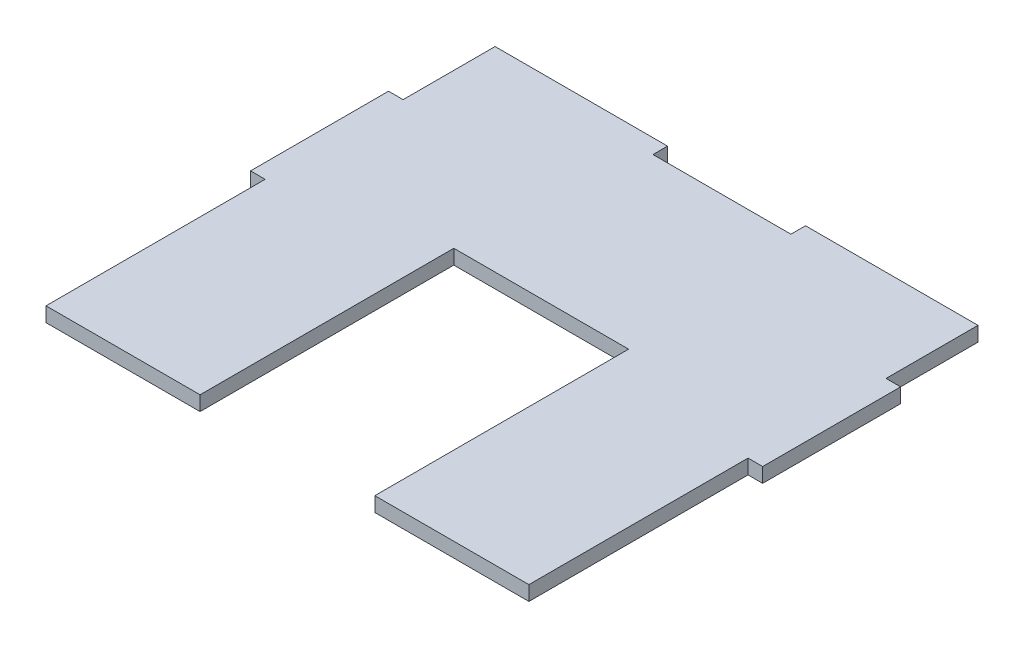
ISO-10303-21;
HEADER;
FILE_DESCRIPTION(('STEP AP214'),'2;1');
FILE_NAME('part.step','',(''),(''),'','','');
FILE_SCHEMA(('AUTOMOTIVE_DESIGN { 1 0 10303 214 1 1 1 1 }'));
ENDSEC;
DATA;
#1=APPLICATION_CONTEXT('core data for automotive mechanical design processes');
#2=APPLICATION_PROTOCOL_DEFINITION('international standard','automotive_design',2000,#1);
#3=PRODUCT_CONTEXT('',#1,'mechanical');
#4=PRODUCT('Part','Part','',(#3));
#5=PRODUCT_RELATED_PRODUCT_CATEGORY('part','',(#4));
#6=PRODUCT_DEFINITION_FORMATION('','',#4);
#7=PRODUCT_DEFINITION_CONTEXT('part definition',#1,'design');
#8=PRODUCT_DEFINITION('design','',#6,#7);
#9=PRODUCT_DEFINITION_SHAPE('','',#8);
#10=(LENGTH_UNIT() NAMED_UNIT(*) SI_UNIT(.MILLI.,.METRE.));
#11=(NAMED_UNIT(*) PLANE_ANGLE_UNIT() SI_UNIT($,.RADIAN.));
#12=(NAMED_UNIT(*) SI_UNIT($,.STERADIAN.) SOLID_ANGLE_UNIT());
#13=UNCERTAINTY_MEASURE_WITH_UNIT(LENGTH_MEASURE(1.E-05),#10,'distance_accuracy_value','');
#14=(GEOMETRIC_REPRESENTATION_CONTEXT(3) GLOBAL_UNCERTAINTY_ASSIGNED_CONTEXT((#13)) GLOBAL_UNIT_ASSIGNED_CONTEXT((#10,
#11,#12)) REPRESENTATION_CONTEXT('',''));
#15=CARTESIAN_POINT('',(0.,0.,0.));
#16=DIRECTION('',(0.,0.,1.));
#17=DIRECTION('',(1.,0.,0.));
#18=AXIS2_PLACEMENT_3D('',#15,#16,#17);
#19=CARTESIAN_POINT('',(67.5,3.175,0.));
#20=DIRECTION('',(-1.,0.,0.));
#21=DIRECTION('',(0.,0.,1.));
#22=AXIS2_PLACEMENT_3D('',#19,#20,#21);
#23=PLANE('',#22);
#24=DIRECTION('',(0.,0.,-1.));
#25=VECTOR('',#24,1.);
#26=CARTESIAN_POINT('',(67.5,0.,0.));
#27=LINE('',#26,#25);
#28=CARTESIAN_POINT('',(67.5,0.,-91.3));
#29=VERTEX_POINT('',#28);
#30=CARTESIAN_POINT('',(67.5,0.,-94.475));
#31=VERTEX_POINT('',#30);
#32=EDGE_CURVE('E292',#29,#31,#27,.T.);
#33=ORIENTED_EDGE('',*,*,#32,.F.);
#34=DIRECTION('',(0.,-1.,0.));
#35=VECTOR('',#34,1.);
#36=CARTESIAN_POINT('',(67.5,3.175,-91.3));
#37=LINE('',#36,#35);
#38=CARTESIAN_POINT('',(67.5,3.175,-91.3));
#39=VERTEX_POINT('',#38);
#40=EDGE_CURVE('E11',#39,#29,#37,.T.);
#41=ORIENTED_EDGE('',*,*,#40,.F.);
#42=DIRECTION('',(0.,0.,-1.));
#43=VECTOR('',#42,1.);
#44=CARTESIAN_POINT('',(67.5,3.175,0.));
#45=LINE('',#44,#43);
#46=CARTESIAN_POINT('',(67.5,3.175,-94.475));
#47=VERTEX_POINT('',#46);
#48=EDGE_CURVE('E261',#39,#47,#45,.T.);
#49=ORIENTED_EDGE('',*,*,#48,.T.);
#50=DIRECTION('',(0.,-1.,0.));
#51=VECTOR('',#50,1.);
#52=CARTESIAN_POINT('',(67.5,3.175,-94.475));
#53=LINE('',#52,#51);
#54=EDGE_CURVE('E58',#47,#31,#53,.T.);
#55=ORIENTED_EDGE('',*,*,#54,.T.);
#56=EDGE_LOOP('',(#33,#41,#49,#55));
#57=FACE_BOUND('',#56,.T.);
#58=ADVANCED_FACE('F41',(#57),#23,.T.);
#59=CARTESIAN_POINT('',(0.,3.175,-91.3));
#60=DIRECTION('',(0.,0.,-1.));
#61=DIRECTION('',(-1.,0.,0.));
#62=AXIS2_PLACEMENT_3D('',#59,#60,#61);
#63=PLANE('',#62);
#64=DIRECTION('',(1.,0.,0.));
#65=VECTOR('',#64,1.);
#66=CARTESIAN_POINT('',(0.,0.,-91.3));
#67=LINE('',#66,#65);
#68=CARTESIAN_POINT('',(37.5,0.,-91.3));
#69=VERTEX_POINT('',#68);
#70=EDGE_CURVE('E287',#69,#29,#67,.T.);
#71=ORIENTED_EDGE('',*,*,#70,.F.);
#72=DIRECTION('',(0.,-1.,0.));
#73=VECTOR('',#72,1.);
#74=CARTESIAN_POINT('',(37.5,3.175,-91.3));
#75=LINE('',#74,#73);
#76=CARTESIAN_POINT('',(37.5,3.175,-91.3));
#77=VERTEX_POINT('',#76);
#78=EDGE_CURVE('E50',#77,#69,#75,.T.);
#79=ORIENTED_EDGE('',*,*,#78,.F.);
#80=DIRECTION('',(1.,0.,0.));
#81=VECTOR('',#80,1.);
#82=CARTESIAN_POINT('',(0.,3.175,-91.3));
#83=LINE('',#82,#81);
#84=EDGE_CURVE('E257',#77,#39,#83,.T.);
#85=ORIENTED_EDGE('',*,*,#84,.T.);
#86=ORIENTED_EDGE('',*,*,#40,.T.);
#87=EDGE_LOOP('',(#71,#79,#85,#86));
#88=FACE_BOUND('',#87,.T.);
#89=ADVANCED_FACE('F360',(#88),#63,.T.);
#90=CARTESIAN_POINT('',(37.5,3.175,0.));
#91=DIRECTION('',(-1.,0.,0.));
#92=DIRECTION('',(0.,0.,1.));
#93=AXIS2_PLACEMENT_3D('',#90,#91,#92);
#94=PLANE('',#93);
#95=DIRECTION('',(0.,0.,-1.));
#96=VECTOR('',#95,1.);
#97=CARTESIAN_POINT('',(37.5,0.,0.));
#98=LINE('',#97,#96);
#99=CARTESIAN_POINT('',(37.5,0.,-94.475));
#100=VERTEX_POINT('',#99);
#101=EDGE_CURVE('E278',#69,#100,#98,.T.);
#102=ORIENTED_EDGE('',*,*,#101,.T.);
#103=DIRECTION('',(0.,-1.,0.));
#104=VECTOR('',#103,1.);
#105=CARTESIAN_POINT('',(37.5,3.175,-94.475));
#106=LINE('',#105,#104);
#107=CARTESIAN_POINT('',(37.5,3.175,-94.475));
#108=VERTEX_POINT('',#107);
#109=EDGE_CURVE('E351',#108,#100,#106,.T.);
#110=ORIENTED_EDGE('',*,*,#109,.F.);
#111=DIRECTION('',(0.,0.,-1.));
#112=VECTOR('',#111,1.);
#113=CARTESIAN_POINT('',(37.5,3.175,0.));
#114=LINE('',#113,#112);
#115=EDGE_CURVE('E254',#77,#108,#114,.T.);
#116=ORIENTED_EDGE('',*,*,#115,.F.);
#117=ORIENTED_EDGE('',*,*,#78,.T.);
#118=EDGE_LOOP('',(#102,#110,#116,#117));
#119=FACE_BOUND('',#118,.T.);
#120=ADVANCED_FACE('F355',(#119),#94,.F.);
#121=CARTESIAN_POINT('',(0.,3.175,-94.475));
#122=DIRECTION('',(0.,0.,-1.));
#123=DIRECTION('',(-1.,0.,0.));
#124=AXIS2_PLACEMENT_3D('',#121,#122,#123);
#125=PLANE('',#124);
#126=DIRECTION('',(1.,0.,0.));
#127=VECTOR('',#126,1.);
#128=CARTESIAN_POINT('',(0.,0.,-94.475));
#129=LINE('',#128,#127);
#130=CARTESIAN_POINT('',(0.,0.,-94.475));
#131=VERTEX_POINT('',#130);
#132=EDGE_CURVE('E268',#131,#100,#129,.T.);
#133=ORIENTED_EDGE('',*,*,#132,.F.);
#134=DIRECTION('',(0.,-1.,0.));
#135=VECTOR('',#134,1.);
#136=CARTESIAN_POINT('',(0.,3.175,-94.475));
#137=LINE('',#136,#135);
#138=CARTESIAN_POINT('',(0.,3.175,-94.475));
#139=VERTEX_POINT('',#138);
#140=EDGE_CURVE('E348',#139,#131,#137,.T.);
#141=ORIENTED_EDGE('',*,*,#140,.F.);
#142=DIRECTION('',(1.,0.,0.));
#143=VECTOR('',#142,1.);
#144=CARTESIAN_POINT('',(0.,3.175,-94.475));
#145=LINE('',#144,#143);
#146=EDGE_CURVE('E210',#139,#108,#145,.T.);
#147=ORIENTED_EDGE('',*,*,#146,.T.);
#148=ORIENTED_EDGE('',*,*,#109,.T.);
#149=EDGE_LOOP('',(#133,#141,#147,#148));
#150=FACE_BOUND('',#149,.T.);
#151=ADVANCED_FACE('F364',(#150),#125,.T.);
#152=CARTESIAN_POINT('',(0.,3.175,0.));
#153=DIRECTION('',(-1.,0.,0.));
#154=DIRECTION('',(0.,0.,1.));
#155=AXIS2_PLACEMENT_3D('',#152,#153,#154);
#156=PLANE('',#155);
#157=DIRECTION('',(0.,0.,-1.));
#158=VECTOR('',#157,1.);
#159=CARTESIAN_POINT('',(0.,0.,0.));
#160=LINE('',#159,#158);
#161=CARTESIAN_POINT('',(0.,0.,-74.475));
#162=VERTEX_POINT('',#161);
#163=EDGE_CURVE('E277',#162,#131,#160,.T.);
#164=ORIENTED_EDGE('',*,*,#163,.F.);
#165=DIRECTION('',(0.,-1.,0.));
#166=VECTOR('',#165,1.);
#167=CARTESIAN_POINT('',(0.,3.175,-74.475));
#168=LINE('',#167,#166);
#169=CARTESIAN_POINT('',(0.,3.175,-74.475));
#170=VERTEX_POINT('',#169);
#171=EDGE_CURVE('E345',#170,#162,#168,.T.);
#172=ORIENTED_EDGE('',*,*,#171,.F.);
#173=DIRECTION('',(0.,0.,-1.));
#174=VECTOR('',#173,1.);
#175=CARTESIAN_POINT('',(0.,3.175,0.));
#176=LINE('',#175,#174);
#177=EDGE_CURVE('E248',#170,#139,#176,.T.);
#178=ORIENTED_EDGE('',*,*,#177,.T.);
#179=ORIENTED_EDGE('',*,*,#140,.T.);
#180=EDGE_LOOP('',(#164,#172,#178,#179));
#181=FACE_BOUND('',#180,.T.);
#182=ADVANCED_FACE('F374',(#181),#156,.T.);
#183=CARTESIAN_POINT('',(0.,3.175,-74.475));
#184=DIRECTION('',(0.,0.,-1.));
#185=DIRECTION('',(-1.,0.,0.));
#186=AXIS2_PLACEMENT_3D('',#183,#184,#185);
#187=PLANE('',#186);
#188=DIRECTION('',(1.,0.,0.));
#189=VECTOR('',#188,1.);
#190=CARTESIAN_POINT('',(0.,0.,-74.475));
#191=LINE('',#190,#189);
#192=CARTESIAN_POINT('',(-3.175,0.,-74.475));
#193=VERTEX_POINT('',#192);
#194=EDGE_CURVE('E284',#193,#162,#191,.T.);
#195=ORIENTED_EDGE('',*,*,#194,.F.);
#196=DIRECTION('',(0.,-1.,0.));
#197=VECTOR('',#196,1.);
#198=CARTESIAN_POINT('',(-3.175,3.175,-74.475));
#199=LINE('',#198,#197);
#200=CARTESIAN_POINT('',(-3.175,3.175,-74.475));
#201=VERTEX_POINT('',#200);
#202=EDGE_CURVE('E342',#201,#193,#199,.T.);
#203=ORIENTED_EDGE('',*,*,#202,.F.);
#204=DIRECTION('',(1.,0.,0.));
#205=VECTOR('',#204,1.);
#206=CARTESIAN_POINT('',(0.,3.175,-74.475));
#207=LINE('',#206,#205);
#208=EDGE_CURVE('E244',#201,#170,#207,.T.);
#209=ORIENTED_EDGE('',*,*,#208,.T.);
#210=ORIENTED_EDGE('',*,*,#171,.T.);
#211=EDGE_LOOP('',(#195,#203,#209,#210));
#212=FACE_BOUND('',#211,.T.);
#213=ADVANCED_FACE('F385',(#212),#187,.T.);
#214=CARTESIAN_POINT('',(-3.175,3.175,0.));
#215=DIRECTION('',(1.,0.,0.));
#216=DIRECTION('',(0.,0.,-1.));
#217=AXIS2_PLACEMENT_3D('',#214,#215,#216);
#218=PLANE('',#217);
#219=DIRECTION('',(0.,0.,1.));
#220=VECTOR('',#219,1.);
#221=CARTESIAN_POINT('',(-3.175,0.,0.));
#222=LINE('',#221,#220);
#223=CARTESIAN_POINT('',(-3.175,0.,-44.475));
#224=VERTEX_POINT('',#223);
#225=EDGE_CURVE('E602',#193,#224,#222,.T.);
#226=ORIENTED_EDGE('',*,*,#225,.T.);
#227=DIRECTION('',(0.,-1.,0.));
#228=VECTOR('',#227,1.);
#229=CARTESIAN_POINT('',(-3.175,3.175,-44.475));
#230=LINE('',#229,#228);
#231=CARTESIAN_POINT('',(-3.175,3.175,-44.475));
#232=VERTEX_POINT('',#231);
#233=EDGE_CURVE('E338',#232,#224,#230,.T.);
#234=ORIENTED_EDGE('',*,*,#233,.F.);
#235=DIRECTION('',(0.,0.,1.));
#236=VECTOR('',#235,1.);
#237=CARTESIAN_POINT('',(-3.175,3.175,0.));
#238=LINE('',#237,#236);
#239=EDGE_CURVE('E241',#201,#232,#238,.T.);
#240=ORIENTED_EDGE('',*,*,#239,.F.);
#241=ORIENTED_EDGE('',*,*,#202,.T.);
#242=EDGE_LOOP('',(#226,#234,#240,#241));
#243=FACE_BOUND('',#242,.T.);
#244=ADVANCED_FACE('F388',(#243),#218,.F.);
#245=CARTESIAN_POINT('',(0.,3.175,-44.475));
#246=DIRECTION('',(0.,0.,-1.));
#247=DIRECTION('',(-1.,0.,0.));
#248=AXIS2_PLACEMENT_3D('',#245,#246,#247);
#249=PLANE('',#248);
#250=DIRECTION('',(1.,0.,0.));
#251=VECTOR('',#250,1.);
#252=CARTESIAN_POINT('',(0.,0.,-44.475));
#253=LINE('',#252,#251);
#254=CARTESIAN_POINT('',(0.,0.,-44.475));
#255=VERTEX_POINT('',#254);
#256=EDGE_CURVE('E606',#224,#255,#253,.T.);
#257=ORIENTED_EDGE('',*,*,#256,.T.);
#258=DIRECTION('',(0.,-1.,0.));
#259=VECTOR('',#258,1.);
#260=CARTESIAN_POINT('',(0.,3.175,-44.475));
#261=LINE('',#260,#259);
#262=CARTESIAN_POINT('',(0.,3.175,-44.475));
#263=VERTEX_POINT('',#262);
#264=EDGE_CURVE('E335',#263,#255,#261,.T.);
#265=ORIENTED_EDGE('',*,*,#264,.F.);
#266=DIRECTION('',(1.,0.,0.));
#267=VECTOR('',#266,1.);
#268=CARTESIAN_POINT('',(0.,3.175,-44.475));
#269=LINE('',#268,#267);
#270=EDGE_CURVE('E238',#232,#263,#269,.T.);
#271=ORIENTED_EDGE('',*,*,#270,.F.);
#272=ORIENTED_EDGE('',*,*,#233,.T.);
#273=EDGE_LOOP('',(#257,#265,#271,#272));
#274=FACE_BOUND('',#273,.T.);
#275=ADVANCED_FACE('F392',(#274),#249,.F.);
#276=CARTESIAN_POINT('',(0.,0.,3.175));
#277=VERTEX_POINT('',#276);
#278=EDGE_CURVE('E285',#277,#255,#160,.T.);
#279=ORIENTED_EDGE('',*,*,#278,.F.);
#280=DIRECTION('',(0.,-1.,0.));
#281=VECTOR('',#280,1.);
#282=CARTESIAN_POINT('',(0.,3.175,3.175));
#283=LINE('',#282,#281);
#284=CARTESIAN_POINT('',(0.,3.175,3.175));
#285=VERTEX_POINT('',#284);
#286=EDGE_CURVE('E332',#285,#277,#283,.T.);
#287=ORIENTED_EDGE('',*,*,#286,.F.);
#288=EDGE_CURVE('E237',#285,#263,#176,.T.);
#289=ORIENTED_EDGE('',*,*,#288,.T.);
#290=ORIENTED_EDGE('',*,*,#264,.T.);
#291=EDGE_LOOP('',(#279,#287,#289,#290));
#292=FACE_BOUND('',#291,.T.);
#293=ADVANCED_FACE('F396',(#292),#156,.T.);
#294=CARTESIAN_POINT('',(0.,3.175,3.175));
#295=DIRECTION('',(0.,0.,-1.));
#296=DIRECTION('',(-1.,0.,0.));
#297=AXIS2_PLACEMENT_3D('',#294,#295,#296);
#298=PLANE('',#297);
#299=DIRECTION('',(1.,0.,0.));
#300=VECTOR('',#299,1.);
#301=CARTESIAN_POINT('',(0.,0.,3.175));
#302=LINE('',#301,#300);
#303=CARTESIAN_POINT('',(33.5,0.,3.175));
#304=VERTEX_POINT('',#303);
#305=EDGE_CURVE('E612',#277,#304,#302,.T.);
#306=ORIENTED_EDGE('',*,*,#305,.T.);
#307=DIRECTION('',(0.,-1.,0.));
#308=VECTOR('',#307,1.);
#309=CARTESIAN_POINT('',(33.5,3.175,3.175));
#310=LINE('',#309,#308);
#311=CARTESIAN_POINT('',(33.5,3.175,3.175));
#312=VERTEX_POINT('',#311);
#313=EDGE_CURVE('E329',#312,#304,#310,.T.);
#314=ORIENTED_EDGE('',*,*,#313,.F.);
#315=DIRECTION('',(1.,0.,0.));
#316=VECTOR('',#315,1.);
#317=CARTESIAN_POINT('',(0.,3.175,3.175));
#318=LINE('',#317,#316);
#319=EDGE_CURVE('E234',#285,#312,#318,.T.);
#320=ORIENTED_EDGE('',*,*,#319,.F.);
#321=ORIENTED_EDGE('',*,*,#286,.T.);
#322=EDGE_LOOP('',(#306,#314,#320,#321));
#323=FACE_BOUND('',#322,.T.);
#324=ADVANCED_FACE('F400',(#323),#298,.F.);
#325=CARTESIAN_POINT('',(33.5,3.175,0.));
#326=DIRECTION('',(1.,0.,0.));
#327=DIRECTION('',(0.,0.,-1.));
#328=AXIS2_PLACEMENT_3D('',#325,#326,#327);
#329=PLANE('',#328);
#330=DIRECTION('',(0.,0.,1.));
#331=VECTOR('',#330,1.);
#332=CARTESIAN_POINT('',(33.5,0.,0.));
#333=LINE('',#332,#331);
#334=CARTESIAN_POINT('',(33.5,0.,-52.));
#335=VERTEX_POINT('',#334);
#336=EDGE_CURVE('E616',#335,#304,#333,.T.);
#337=ORIENTED_EDGE('',*,*,#336,.F.);
#338=DIRECTION('',(0.,-1.,0.));
#339=VECTOR('',#338,1.);
#340=CARTESIAN_POINT('',(33.5,3.175,-52.));
#341=LINE('',#340,#339);
#342=CARTESIAN_POINT('',(33.5,3.175,-52.));
#343=VERTEX_POINT('',#342);
#344=EDGE_CURVE('E326',#343,#335,#341,.T.);
#345=ORIENTED_EDGE('',*,*,#344,.F.);
#346=DIRECTION('',(0.,0.,1.));
#347=VECTOR('',#346,1.);
#348=CARTESIAN_POINT('',(33.5,3.175,0.));
#349=LINE('',#348,#347);
#350=EDGE_CURVE('E230',#343,#312,#349,.T.);
#351=ORIENTED_EDGE('',*,*,#350,.T.);
#352=ORIENTED_EDGE('',*,*,#313,.T.);
#353=EDGE_LOOP('',(#337,#345,#351,#352));
#354=FACE_BOUND('',#353,.T.);
#355=ADVANCED_FACE('F404',(#354),#329,.T.);
#356=CARTESIAN_POINT('',(0.,3.175,-52.));
#357=DIRECTION('',(0.,0.,-1.));
#358=DIRECTION('',(-1.,0.,0.));
#359=AXIS2_PLACEMENT_3D('',#356,#357,#358);
#360=PLANE('',#359);
#361=DIRECTION('',(1.,0.,0.));
#362=VECTOR('',#361,1.);
#363=CARTESIAN_POINT('',(0.,0.,-52.));
#364=LINE('',#363,#362);
#365=CARTESIAN_POINT('',(71.5,0.,-52.));
#366=VERTEX_POINT('',#365);
#367=EDGE_CURVE('E620',#335,#366,#364,.T.);
#368=ORIENTED_EDGE('',*,*,#367,.T.);
#369=DIRECTION('',(0.,-1.,0.));
#370=VECTOR('',#369,1.);
#371=CARTESIAN_POINT('',(71.5,3.175,-52.));
#372=LINE('',#371,#370);
#373=CARTESIAN_POINT('',(71.5,3.175,-52.));
#374=VERTEX_POINT('',#373);
#375=EDGE_CURVE('E322',#374,#366,#372,.T.);
#376=ORIENTED_EDGE('',*,*,#375,.F.);
#377=DIRECTION('',(1.,0.,0.));
#378=VECTOR('',#377,1.);
#379=CARTESIAN_POINT('',(0.,3.175,-52.));
#380=LINE('',#379,#378);
#381=EDGE_CURVE('E225',#343,#374,#380,.T.);
#382=ORIENTED_EDGE('',*,*,#381,.F.);
#383=ORIENTED_EDGE('',*,*,#344,.T.);
#384=EDGE_LOOP('',(#368,#376,#382,#383));
#385=FACE_BOUND('',#384,.T.);
#386=ADVANCED_FACE('F408',(#385),#360,.F.);
#387=CARTESIAN_POINT('',(71.5,3.175,0.));
#388=DIRECTION('',(1.,0.,0.));
#389=DIRECTION('',(0.,0.,-1.));
#390=AXIS2_PLACEMENT_3D('',#387,#388,#389);
#391=PLANE('',#390);
#392=DIRECTION('',(0.,0.,1.));
#393=VECTOR('',#392,1.);
#394=CARTESIAN_POINT('',(71.5,0.,0.));
#395=LINE('',#394,#393);
#396=CARTESIAN_POINT('',(71.5,0.,3.175));
#397=VERTEX_POINT('',#396);
#398=EDGE_CURVE('E623',#366,#397,#395,.T.);
#399=ORIENTED_EDGE('',*,*,#398,.T.);
#400=DIRECTION('',(0.,-1.,0.));
#401=VECTOR('',#400,1.);
#402=CARTESIAN_POINT('',(71.5,3.175,3.175));
#403=LINE('',#402,#401);
#404=CARTESIAN_POINT('',(71.5,3.175,3.175));
#405=VERTEX_POINT('',#404);
#406=EDGE_CURVE('E318',#405,#397,#403,.T.);
#407=ORIENTED_EDGE('',*,*,#406,.F.);
#408=DIRECTION('',(0.,0.,1.));
#409=VECTOR('',#408,1.);
#410=CARTESIAN_POINT('',(71.5,3.175,0.));
#411=LINE('',#410,#409);
#412=EDGE_CURVE('E221',#374,#405,#411,.T.);
#413=ORIENTED_EDGE('',*,*,#412,.F.);
#414=ORIENTED_EDGE('',*,*,#375,.T.);
#415=EDGE_LOOP('',(#399,#407,#413,#414));
#416=FACE_BOUND('',#415,.T.);
#417=ADVANCED_FACE('F412',(#416),#391,.F.);
#418=CARTESIAN_POINT('',(0.,3.175,3.175));
#419=DIRECTION('',(0.,0.,-1.));
#420=DIRECTION('',(-1.,0.,0.));
#421=AXIS2_PLACEMENT_3D('',#418,#419,#420);
#422=PLANE('',#421);
#423=DIRECTION('',(1.,0.,0.));
#424=VECTOR('',#423,1.);
#425=CARTESIAN_POINT('',(0.,0.,3.175));
#426=LINE('',#425,#424);
#427=CARTESIAN_POINT('',(105.,0.,3.175));
#428=VERTEX_POINT('',#427);
#429=EDGE_CURVE('E626',#397,#428,#426,.T.);
#430=ORIENTED_EDGE('',*,*,#429,.T.);
#431=DIRECTION('',(0.,-1.,0.));
#432=VECTOR('',#431,1.);
#433=CARTESIAN_POINT('',(105.,3.175,3.175));
#434=LINE('',#433,#432);
#435=CARTESIAN_POINT('',(105.,3.175,3.175));
#436=VERTEX_POINT('',#435);
#437=EDGE_CURVE('E314',#436,#428,#434,.T.);
#438=ORIENTED_EDGE('',*,*,#437,.F.);
#439=DIRECTION('',(1.,0.,0.));
#440=VECTOR('',#439,1.);
#441=CARTESIAN_POINT('',(0.,3.175,3.175));
#442=LINE('',#441,#440);
#443=EDGE_CURVE('E215',#405,#436,#442,.T.);
#444=ORIENTED_EDGE('',*,*,#443,.F.);
#445=ORIENTED_EDGE('',*,*,#406,.T.);
#446=EDGE_LOOP('',(#430,#438,#444,#445));
#447=FACE_BOUND('',#446,.T.);
#448=ADVANCED_FACE('F416',(#447),#422,.F.);
#449=CARTESIAN_POINT('',(105.,3.175,0.));
#450=DIRECTION('',(-1.,0.,0.));
#451=DIRECTION('',(0.,0.,1.));
#452=AXIS2_PLACEMENT_3D('',#449,#450,#451);
#453=PLANE('',#452);
#454=DIRECTION('',(0.,0.,-1.));
#455=VECTOR('',#454,1.);
#456=CARTESIAN_POINT('',(105.,0.,0.));
#457=LINE('',#456,#455);
#458=CARTESIAN_POINT('',(105.,0.,-44.475));
#459=VERTEX_POINT('',#458);
#460=EDGE_CURVE('E272',#428,#459,#457,.T.);
#461=ORIENTED_EDGE('',*,*,#460,.T.);
#462=DIRECTION('',(0.,-1.,0.));
#463=VECTOR('',#462,1.);
#464=CARTESIAN_POINT('',(105.,3.175,-44.475));
#465=LINE('',#464,#463);
#466=CARTESIAN_POINT('',(105.,3.175,-44.475));
#467=VERTEX_POINT('',#466);
#468=EDGE_CURVE('E308',#467,#459,#465,.T.);
#469=ORIENTED_EDGE('',*,*,#468,.F.);
#470=DIRECTION('',(0.,0.,-1.));
#471=VECTOR('',#470,1.);
#472=CARTESIAN_POINT('',(105.,3.175,0.));
#473=LINE('',#472,#471);
#474=EDGE_CURVE('E207',#436,#467,#473,.T.);
#475=ORIENTED_EDGE('',*,*,#474,.F.);
#476=ORIENTED_EDGE('',*,*,#437,.T.);
#477=EDGE_LOOP('',(#461,#469,#475,#476));
#478=FACE_BOUND('',#477,.T.);
#479=ADVANCED_FACE('F371',(#478),#453,.F.);
#480=CARTESIAN_POINT('',(0.,3.175,-44.475));
#481=DIRECTION('',(0.,0.,1.));
#482=DIRECTION('',(1.,0.,0.));
#483=AXIS2_PLACEMENT_3D('',#480,#481,#482);
#484=PLANE('',#483);
#485=DIRECTION('',(-1.,0.,0.));
#486=VECTOR('',#485,1.);
#487=CARTESIAN_POINT('',(0.,0.,-44.475));
#488=LINE('',#487,#486);
#489=CARTESIAN_POINT('',(108.175,0.,-44.475));
#490=VERTEX_POINT('',#489);
#491=EDGE_CURVE('E631',#490,#459,#488,.T.);
#492=ORIENTED_EDGE('',*,*,#491,.F.);
#493=DIRECTION('',(0.,-1.,0.));
#494=VECTOR('',#493,1.);
#495=CARTESIAN_POINT('',(108.175,3.175,-44.475));
#496=LINE('',#495,#494);
#497=CARTESIAN_POINT('',(108.175,3.175,-44.475));
#498=VERTEX_POINT('',#497);
#499=EDGE_CURVE('E301',#498,#490,#496,.T.);
#500=ORIENTED_EDGE('',*,*,#499,.F.);
#501=DIRECTION('',(-1.,0.,0.));
#502=VECTOR('',#501,1.);
#503=CARTESIAN_POINT('',(0.,3.175,-44.475));
#504=LINE('',#503,#502);
#505=EDGE_CURVE('E214',#498,#467,#504,.T.);
#506=ORIENTED_EDGE('',*,*,#505,.T.);
#507=ORIENTED_EDGE('',*,*,#468,.T.);
#508=EDGE_LOOP('',(#492,#500,#506,#507));
#509=FACE_BOUND('',#508,.T.);
#510=ADVANCED_FACE('F421',(#509),#484,.T.);
#511=CARTESIAN_POINT('',(108.175,3.175,0.));
#512=DIRECTION('',(1.,0.,0.));
#513=DIRECTION('',(0.,0.,-1.));
#514=AXIS2_PLACEMENT_3D('',#511,#512,#513);
#515=PLANE('',#514);
#516=DIRECTION('',(0.,0.,1.));
#517=VECTOR('',#516,1.);
#518=CARTESIAN_POINT('',(108.175,0.,0.));
#519=LINE('',#518,#517);
#520=CARTESIAN_POINT('',(108.175,0.,-74.475));
#521=VERTEX_POINT('',#520);
#522=EDGE_CURVE('E304',#521,#490,#519,.T.);
#523=ORIENTED_EDGE('',*,*,#522,.F.);
#524=DIRECTION('',(0.,-1.,0.));
#525=VECTOR('',#524,1.);
#526=CARTESIAN_POINT('',(108.175,3.175,-74.475));
#527=LINE('',#526,#525);
#528=CARTESIAN_POINT('',(108.175,3.175,-74.475));
#529=VERTEX_POINT('',#528);
#530=EDGE_CURVE('E201',#529,#521,#527,.T.);
#531=ORIENTED_EDGE('',*,*,#530,.F.);
#532=DIRECTION('',(0.,0.,1.));
#533=VECTOR('',#532,1.);
#534=CARTESIAN_POINT('',(108.175,3.175,0.));
#535=LINE('',#534,#533);
#536=EDGE_CURVE('E189',#529,#498,#535,.T.);
#537=ORIENTED_EDGE('',*,*,#536,.T.);
#538=ORIENTED_EDGE('',*,*,#499,.T.);
#539=EDGE_LOOP('',(#523,#531,#537,#538));
#540=FACE_BOUND('',#539,.T.);
#541=ADVANCED_FACE('F300',(#540),#515,.T.);
#542=CARTESIAN_POINT('',(0.,3.175,-74.475));
#543=DIRECTION('',(0.,0.,1.));
#544=DIRECTION('',(1.,0.,0.));
#545=AXIS2_PLACEMENT_3D('',#542,#543,#544);
#546=PLANE('',#545);
#547=DIRECTION('',(-1.,0.,0.));
#548=VECTOR('',#547,1.);
#549=CARTESIAN_POINT('',(0.,0.,-74.475));
#550=LINE('',#549,#548);
#551=CARTESIAN_POINT('',(105.,0.,-74.475));
#552=VERTEX_POINT('',#551);
#553=EDGE_CURVE('E197',#521,#552,#550,.T.);
#554=ORIENTED_EDGE('',*,*,#553,.T.);
#555=DIRECTION('',(0.,-1.,0.));
#556=VECTOR('',#555,1.);
#557=CARTESIAN_POINT('',(105.,3.175,-74.475));
#558=LINE('',#557,#556);
#559=CARTESIAN_POINT('',(105.,3.175,-74.475));
#560=VERTEX_POINT('',#559);
#561=EDGE_CURVE('E194',#560,#552,#558,.T.);
#562=ORIENTED_EDGE('',*,*,#561,.F.);
#563=DIRECTION('',(-1.,0.,0.));
#564=VECTOR('',#563,1.);
#565=CARTESIAN_POINT('',(0.,3.175,-74.475));
#566=LINE('',#565,#564);
#567=EDGE_CURVE('E181',#529,#560,#566,.T.);
#568=ORIENTED_EDGE('',*,*,#567,.F.);
#569=ORIENTED_EDGE('',*,*,#530,.T.);
#570=EDGE_LOOP('',(#554,#562,#568,#569));
#571=FACE_BOUND('',#570,.T.);
#572=ADVANCED_FACE('F195',(#571),#546,.F.);
#573=CARTESIAN_POINT('',(105.,0.,-94.475));
#574=VERTEX_POINT('',#573);
#575=EDGE_CURVE('E266',#552,#574,#457,.T.);
#576=ORIENTED_EDGE('',*,*,#575,.T.);
#577=DIRECTION('',(0.,-1.,0.));
#578=VECTOR('',#577,1.);
#579=CARTESIAN_POINT('',(105.,3.175,-94.475));
#580=LINE('',#579,#578);
#581=CARTESIAN_POINT('',(105.,3.175,-94.475));
#582=VERTEX_POINT('',#581);
#583=EDGE_CURVE('E120',#582,#574,#580,.T.);
#584=ORIENTED_EDGE('',*,*,#583,.F.);
#585=EDGE_CURVE('E186',#560,#582,#473,.T.);
#586=ORIENTED_EDGE('',*,*,#585,.F.);
#587=ORIENTED_EDGE('',*,*,#561,.T.);
#588=EDGE_LOOP('',(#576,#584,#586,#587));
#589=FACE_BOUND('',#588,.T.);
#590=ADVANCED_FACE('F203',(#589),#453,.F.);
#591=EDGE_CURVE('E263',#31,#574,#129,.T.);
#592=ORIENTED_EDGE('',*,*,#591,.F.);
#593=ORIENTED_EDGE('',*,*,#54,.F.);
#594=EDGE_CURVE('E205',#47,#582,#145,.T.);
#595=ORIENTED_EDGE('',*,*,#594,.T.);
#596=ORIENTED_EDGE('',*,*,#583,.T.);
#597=EDGE_LOOP('',(#592,#593,#595,#596));
#598=FACE_BOUND('',#597,.T.);
#599=ADVANCED_FACE('F361',(#598),#125,.T.);
#600=CARTESIAN_POINT('',(0.,3.175,0.));
#601=DIRECTION('',(0.,1.,0.));
#602=DIRECTION('',(0.,0.,1.));
#603=AXIS2_PLACEMENT_3D('',#600,#601,#602);
#604=PLANE('',#603);
#605=ORIENTED_EDGE('',*,*,#48,.F.);
#606=ORIENTED_EDGE('',*,*,#84,.F.);
#607=ORIENTED_EDGE('',*,*,#115,.T.);
#608=ORIENTED_EDGE('',*,*,#146,.F.);
#609=ORIENTED_EDGE('',*,*,#177,.F.);
#610=ORIENTED_EDGE('',*,*,#208,.F.);
#611=ORIENTED_EDGE('',*,*,#239,.T.);
#612=ORIENTED_EDGE('',*,*,#270,.T.);
#613=ORIENTED_EDGE('',*,*,#288,.F.);
#614=ORIENTED_EDGE('',*,*,#319,.T.);
#615=ORIENTED_EDGE('',*,*,#350,.F.);
#616=ORIENTED_EDGE('',*,*,#381,.T.);
#617=ORIENTED_EDGE('',*,*,#412,.T.);
#618=ORIENTED_EDGE('',*,*,#443,.T.);
#619=ORIENTED_EDGE('',*,*,#474,.T.);
#620=ORIENTED_EDGE('',*,*,#505,.F.);
#621=ORIENTED_EDGE('',*,*,#536,.F.);
#622=ORIENTED_EDGE('',*,*,#567,.T.);
#623=ORIENTED_EDGE('',*,*,#585,.T.);
#624=ORIENTED_EDGE('',*,*,#594,.F.);
#625=EDGE_LOOP('',(#605,#606,#607,#608,#609,#610,#611,#612,#613,#614,#615,#616,#617,#618,#619,
#620,#621,#622,#623,#624));
#626=FACE_BOUND('',#625,.T.);
#627=ADVANCED_FACE('F183',(#626),#604,.T.);
#628=CARTESIAN_POINT('',(0.,0.,0.));
#629=DIRECTION('',(0.,1.,0.));
#630=DIRECTION('',(0.,0.,1.));
#631=AXIS2_PLACEMENT_3D('',#628,#629,#630);
#632=PLANE('',#631);
#633=ORIENTED_EDGE('',*,*,#32,.T.);
#634=ORIENTED_EDGE('',*,*,#591,.T.);
#635=ORIENTED_EDGE('',*,*,#575,.F.);
#636=ORIENTED_EDGE('',*,*,#553,.F.);
#637=ORIENTED_EDGE('',*,*,#522,.T.);
#638=ORIENTED_EDGE('',*,*,#491,.T.);
#639=ORIENTED_EDGE('',*,*,#460,.F.);
#640=ORIENTED_EDGE('',*,*,#429,.F.);
#641=ORIENTED_EDGE('',*,*,#398,.F.);
#642=ORIENTED_EDGE('',*,*,#367,.F.);
#643=ORIENTED_EDGE('',*,*,#336,.T.);
#644=ORIENTED_EDGE('',*,*,#305,.F.);
#645=ORIENTED_EDGE('',*,*,#278,.T.);
#646=ORIENTED_EDGE('',*,*,#256,.F.);
#647=ORIENTED_EDGE('',*,*,#225,.F.);
#648=ORIENTED_EDGE('',*,*,#194,.T.);
#649=ORIENTED_EDGE('',*,*,#163,.T.);
#650=ORIENTED_EDGE('',*,*,#132,.T.);
#651=ORIENTED_EDGE('',*,*,#101,.F.);
#652=ORIENTED_EDGE('',*,*,#70,.T.);
#653=EDGE_LOOP('',(#633,#634,#635,#636,#637,#638,#639,#640,#641,#642,#643,#644,#645,#646,#647,
#648,#649,#650,#651,#652));
#654=FACE_BOUND('',#653,.T.);
#655=ADVANCED_FACE('F359',(#654),#632,.F.);
#656=CLOSED_SHELL('',(#58,#89,#120,#151,#182,#213,#244,#275,#293,#324,#355,#386,#417,#448,#479,
#510,#541,#572,#590,#599,#627,#655));
#657=MANIFOLD_SOLID_BREP('B2',#656);
#658=ADVANCED_BREP_SHAPE_REPRESENTATION('',(#18,#657),#14);
#659=SHAPE_DEFINITION_REPRESENTATION(#9,#658);
ENDSEC;
END-ISO-10303-21;
